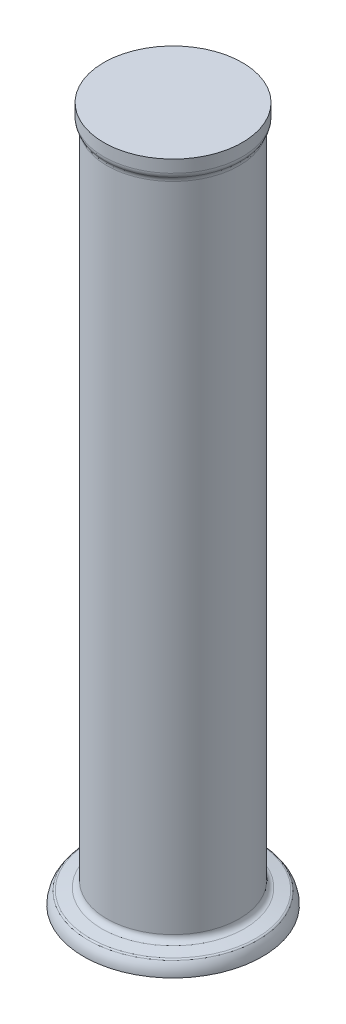
ISO-10303-21;
HEADER;
FILE_DESCRIPTION(('STEP AP214'),'2;1');
FILE_NAME('part.step','',(''),(''),'','','');
FILE_SCHEMA(('AUTOMOTIVE_DESIGN { 1 0 10303 214 1 1 1 1 }'));
ENDSEC;
DATA;
#1=APPLICATION_CONTEXT('core data for automotive mechanical design processes');
#2=APPLICATION_PROTOCOL_DEFINITION('international standard','automotive_design',2000,#1);
#3=PRODUCT_CONTEXT('',#1,'mechanical');
#4=PRODUCT('Part','Part','',(#3));
#5=PRODUCT_RELATED_PRODUCT_CATEGORY('part','',(#4));
#6=PRODUCT_DEFINITION_FORMATION('','',#4);
#7=PRODUCT_DEFINITION_CONTEXT('part definition',#1,'design');
#8=PRODUCT_DEFINITION('design','',#6,#7);
#9=PRODUCT_DEFINITION_SHAPE('','',#8);
#10=(LENGTH_UNIT() NAMED_UNIT(*) SI_UNIT(.MILLI.,.METRE.));
#11=(NAMED_UNIT(*) PLANE_ANGLE_UNIT() SI_UNIT($,.RADIAN.));
#12=(NAMED_UNIT(*) SI_UNIT($,.STERADIAN.) SOLID_ANGLE_UNIT());
#13=UNCERTAINTY_MEASURE_WITH_UNIT(LENGTH_MEASURE(1.E-05),#10,'distance_accuracy_value','');
#14=(GEOMETRIC_REPRESENTATION_CONTEXT(3) GLOBAL_UNCERTAINTY_ASSIGNED_CONTEXT((#13)) GLOBAL_UNIT_ASSIGNED_CONTEXT((#10,
#11,#12)) REPRESENTATION_CONTEXT('',''));
#15=CARTESIAN_POINT('',(0.,0.,0.));
#16=DIRECTION('',(0.,0.,1.));
#17=DIRECTION('',(1.,0.,0.));
#18=AXIS2_PLACEMENT_3D('',#15,#16,#17);
#19=CARTESIAN_POINT('',(-58.0000000000025,807.,-48.1907105375432));
#20=DIRECTION('',(0.,-1.,0.));
#21=DIRECTION('',(1.,0.,0.));
#22=AXIS2_PLACEMENT_3D('',#19,#20,#21);
#23=PLANE('',#22);
#24=CARTESIAN_POINT('',(-2.50022225145585E-12,807.,-48.1907105375428));
#25=DIRECTION('',(0.,1.,0.));
#26=DIRECTION('',(-1.,0.,0.));
#27=AXIS2_PLACEMENT_3D('',#24,#25,#26);
#28=CIRCLE('',#27,58.);
#29=CARTESIAN_POINT('',(-58.0000000000025,807.,-48.1907105375428));
#30=VERTEX_POINT('',#29);
#31=EDGE_CURVE('E37',#30,#30,#28,.T.);
#32=ORIENTED_EDGE('',*,*,#31,.F.);
#33=EDGE_LOOP('',(#32));
#34=FACE_BOUND('',#33,.T.);
#35=ADVANCED_FACE('F34',(#34),#23,.T.);
#36=CARTESIAN_POINT('',(-2.50022225145585E-12,807.,-48.1907105375428));
#37=DIRECTION('',(0.,1.,0.));
#38=DIRECTION('',(-1.,0.,0.));
#39=AXIS2_PLACEMENT_3D('',#36,#37,#38);
#40=TOROIDAL_SURFACE('',#39,45.7295895079795,12.2704104920205);
#41=CARTESIAN_POINT('',(-2.53243799590855E-12,814.875398098358,-48.1907105375428));
#42=DIRECTION('',(0.,1.,0.));
#43=DIRECTION('',(0.,0.,1.));
#44=AXIS2_PLACEMENT_3D('',#41,#42,#43);
#45=CIRCLE('',#44,55.1392164099921);
#46=CARTESIAN_POINT('',(-2.91198232714116E-12,814.875398098358,6.94850587244929));
#47=VERTEX_POINT('',#46);
#48=EDGE_CURVE('E81',#47,#47,#45,.T.);
#49=ORIENTED_EDGE('',*,*,#48,.F.);
#50=EDGE_LOOP('',(#49));
#51=FACE_BOUND('',#50,.T.);
#52=ORIENTED_EDGE('',*,*,#31,.T.);
#53=EDGE_LOOP('',(#52));
#54=FACE_BOUND('',#53,.T.);
#55=ADVANCED_FACE('F92',(#51,#54),#40,.T.);
#56=CARTESIAN_POINT('',(-45.0006854519809,1258.3,-48.1907105375429));
#57=DIRECTION('',(0.,1.,0.));
#58=DIRECTION('',(0.,0.,1.));
#59=AXIS2_PLACEMENT_3D('',#56,#57,#58);
#60=PLANE('',#59);
#61=CARTESIAN_POINT('',(-4.31946145518238E-12,1258.30000000002,-48.1907105375426));
#62=DIRECTION('',(0.,1.,0.));
#63=DIRECTION('',(-1.,0.,0.));
#64=AXIS2_PLACEMENT_3D('',#61,#62,#63);
#65=CIRCLE('',#64,45.0006854519766);
#66=CARTESIAN_POINT('',(-45.0006854519809,1258.30000000002,-48.1907105375426));
#67=VERTEX_POINT('',#66);
#68=EDGE_CURVE('E78',#67,#67,#65,.F.);
#69=ORIENTED_EDGE('',*,*,#68,.F.);
#70=EDGE_LOOP('',(#69));
#71=FACE_BOUND('',#70,.T.);
#72=ADVANCED_FACE('F89',(#71),#60,.T.);
#73=CARTESIAN_POINT('',(-2.52775578246656E-12,813.71797430624,-48.1907105375428));
#74=DIRECTION('',(0.,1.,0.));
#75=DIRECTION('',(0.,0.,1.));
#76=AXIS2_PLACEMENT_3D('',#73,#74,#75);
#77=TOROIDAL_SURFACE('',#76,53.7563115821574,1.80334566775437);
#78=CARTESIAN_POINT('',(-2.52864396088626E-12,815.493923101205,-48.1907105375428));
#79=DIRECTION('',(0.,-1.,0.));
#80=DIRECTION('',(1.,0.,0.));
#81=AXIS2_PLACEMENT_3D('',#78,#79,#80);
#82=CIRCLE('',#81,54.0694592710667);
#83=CARTESIAN_POINT('',(54.0694592710642,815.493923101206,-48.1907105375424));
#84=VERTEX_POINT('',#83);
#85=EDGE_CURVE('E75',#84,#84,#82,.F.);
#86=ORIENTED_EDGE('',*,*,#85,.F.);
#87=EDGE_LOOP('',(#86));
#88=FACE_BOUND('',#87,.T.);
#89=ORIENTED_EDGE('',*,*,#48,.T.);
#90=EDGE_LOOP('',(#89));
#91=FACE_BOUND('',#90,.T.);
#92=ADVANCED_FACE('F84',(#88,#91),#77,.T.);
#93=CARTESIAN_POINT('',(-4.31946145518225E-12,1258.29999999999,-48.1907105375426));
#94=DIRECTION('',(0.,1.,0.));
#95=DIRECTION('',(-1.,0.,0.));
#96=AXIS2_PLACEMENT_3D('',#93,#94,#95);
#97=CONICAL_SURFACE('',#96,45.0006854519766,8.56814967798771E-05);
#98=ORIENTED_EDGE('',*,*,#68,.T.);
#99=EDGE_LOOP('',(#98));
#100=FACE_BOUND('',#99,.T.);
#101=CARTESIAN_POINT('',(-4.29345274776142E-12,1250.29957159252,-48.1907105375426));
#102=DIRECTION('',(0.,1.,0.));
#103=DIRECTION('',(0.,0.,1.));
#104=AXIS2_PLACEMENT_3D('',#101,#102,#103);
#105=CIRCLE('',#104,44.9999999701759);
#106=CARTESIAN_POINT('',(-4.60320497142655E-12,1250.29957159252,-3.19071056736676));
#107=VERTEX_POINT('',#106);
#108=EDGE_CURVE('E72',#107,#107,#105,.F.);
#109=ORIENTED_EDGE('',*,*,#108,.F.);
#110=EDGE_LOOP('',(#109));
#111=FACE_BOUND('',#110,.T.);
#112=ADVANCED_FACE('F88',(#100,#111),#97,.T.);
#113=CARTESIAN_POINT('',(-2.52922682797418E-12,815.493923101205,-48.1907105375428));
#114=DIRECTION('',(0.,-1.,0.));
#115=DIRECTION('',(1.,0.,0.));
#116=AXIS2_PLACEMENT_3D('',#113,#114,#115);
#117=CONICAL_SURFACE('',#116,54.0694592710667,1.39626340159545);
#118=ORIENTED_EDGE('',*,*,#85,.T.);
#119=EDGE_LOOP('',(#118));
#120=FACE_BOUND('',#119,.T.);
#121=CARTESIAN_POINT('',(-2.54024182466655E-12,816.862934945208,-48.1907105375428));
#122=DIRECTION('',(0.,1.,0.));
#123=DIRECTION('',(-1.,0.,0.));
#124=AXIS2_PLACEMENT_3D('',#121,#122,#123);
#125=CIRCLE('',#124,46.3054072893322);
#126=CARTESIAN_POINT('',(-46.3054072893347,816.862934945208,-48.1907105375431));
#127=VERTEX_POINT('',#126);
#128=EDGE_CURVE('E70',#127,#127,#125,.F.);
#129=ORIENTED_EDGE('',*,*,#128,.T.);
#130=EDGE_LOOP('',(#129));
#131=FACE_BOUND('',#130,.T.);
#132=ADVANCED_FACE('F137',(#120,#131),#117,.T.);
#133=CARTESIAN_POINT('',(-4.29345448083041E-12,1250.3,-48.1907105375426));
#134=DIRECTION('',(0.,1.,0.));
#135=DIRECTION('',(0.,0.,1.));
#136=AXIS2_PLACEMENT_3D('',#133,#134,#135);
#137=TOROIDAL_SURFACE('',#136,40.0000000000001,4.99999998852913);
#138=ORIENTED_EDGE('',*,*,#108,.T.);
#139=EDGE_LOOP('',(#138));
#140=FACE_BOUND('',#139,.T.);
#141=CARTESIAN_POINT('',(-4.2745043615844E-12,1247.30000000138,-48.1907105375426));
#142=DIRECTION('',(0.,1.,0.));
#143=DIRECTION('',(-1.,0.,0.));
#144=AXIS2_PLACEMENT_3D('',#141,#142,#143);
#145=CIRCLE('',#144,43.9999999981647);
#146=CARTESIAN_POINT('',(-43.9999999981689,1247.30000000138,-48.190710537543));
#147=VERTEX_POINT('',#146);
#148=EDGE_CURVE('E46',#147,#147,#145,.T.);
#149=ORIENTED_EDGE('',*,*,#148,.T.);
#150=EDGE_LOOP('',(#149));
#151=FACE_BOUND('',#150,.T.);
#152=ADVANCED_FACE('F63',(#140,#151),#137,.T.);
#153=CARTESIAN_POINT('',(-2.55617749189696E-12,820.802165957257,-48.1907105375428));
#154=DIRECTION('',(0.,1.,0.));
#155=DIRECTION('',(-1.,0.,0.));
#156=AXIS2_PLACEMENT_3D('',#153,#154,#155);
#157=TOROIDAL_SURFACE('',#156,47.,4.);
#158=ORIENTED_EDGE('',*,*,#128,.F.);
#159=EDGE_LOOP('',(#158));
#160=FACE_BOUND('',#159,.T.);
#161=CARTESIAN_POINT('',(-2.5498399416421E-12,820.802165957257,-48.1907105375428));
#162=DIRECTION('',(0.,-1.,0.));
#163=DIRECTION('',(1.,0.,0.));
#164=AXIS2_PLACEMENT_3D('',#161,#162,#163);
#165=CIRCLE('',#164,43.);
#166=CARTESIAN_POINT('',(42.9999999999975,820.802165957257,-48.1907105375428));
#167=VERTEX_POINT('',#166);
#168=EDGE_CURVE('E41',#167,#167,#165,.F.);
#169=ORIENTED_EDGE('',*,*,#168,.F.);
#170=EDGE_LOOP('',(#169));
#171=FACE_BOUND('',#170,.T.);
#172=ADVANCED_FACE('F58',(#160,#171),#157,.F.);
#173=CARTESIAN_POINT('',(-4.2623682361409E-12,1244.3,-48.1907105375426));
#174=DIRECTION('',(0.,1.,0.));
#175=DIRECTION('',(-1.,0.,0.));
#176=AXIS2_PLACEMENT_3D('',#173,#174,#175);
#177=TOROIDAL_SURFACE('',#176,48.,5.00000000229416);
#178=CARTESIAN_POINT('',(-4.2630475538541E-12,1244.3,-48.1907105375426));
#179=DIRECTION('',(0.,-1.,0.));
#180=DIRECTION('',(1.,0.,0.));
#181=AXIS2_PLACEMENT_3D('',#178,#179,#180);
#182=CIRCLE('',#181,43.);
#183=CARTESIAN_POINT('',(42.9999999999957,1244.3,-48.1907105375426));
#184=VERTEX_POINT('',#183);
#185=EDGE_CURVE('E10',#184,#184,#182,.T.);
#186=ORIENTED_EDGE('',*,*,#185,.F.);
#187=EDGE_LOOP('',(#186));
#188=FACE_BOUND('',#187,.T.);
#189=ORIENTED_EDGE('',*,*,#148,.F.);
#190=EDGE_LOOP('',(#189));
#191=FACE_BOUND('',#190,.T.);
#192=ADVANCED_FACE('F53',(#188,#191),#177,.F.);
#193=CARTESIAN_POINT('',(-2.49400500251795E-12,807.,-48.1907105375428));
#194=DIRECTION('',(0.,-1.,0.));
#195=DIRECTION('',(1.,0.,0.));
#196=AXIS2_PLACEMENT_3D('',#193,#194,#195);
#197=CYLINDRICAL_SURFACE('',#196,43.);
#198=ORIENTED_EDGE('',*,*,#168,.T.);
#199=EDGE_LOOP('',(#198));
#200=FACE_BOUND('',#199,.T.);
#201=ORIENTED_EDGE('',*,*,#185,.T.);
#202=EDGE_LOOP('',(#201));
#203=FACE_BOUND('',#202,.T.);
#204=ADVANCED_FACE('F57',(#200,#203),#197,.T.);
#205=CLOSED_SHELL('',(#35,#55,#72,#92,#112,#132,#152,#172,#192,#204));
#206=MANIFOLD_SOLID_BREP('B2',#205);
#207=ADVANCED_BREP_SHAPE_REPRESENTATION('',(#18,#206),#14);
#208=SHAPE_DEFINITION_REPRESENTATION(#9,#207);
ENDSEC;
END-ISO-10303-21;
